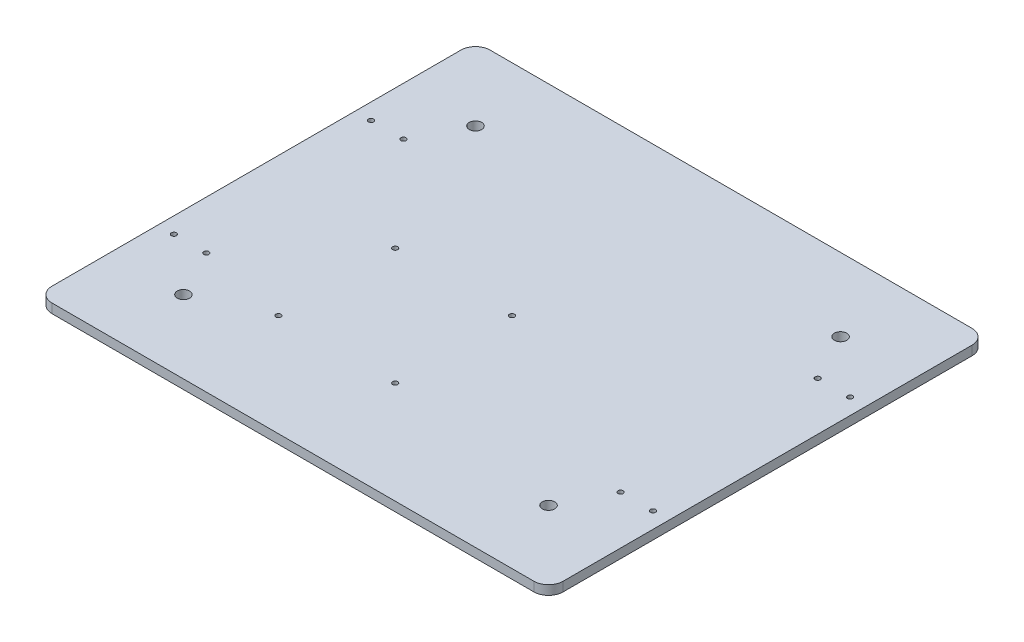
ISO-10303-21;
HEADER;
FILE_DESCRIPTION(('STEP AP214'),'2;1');
FILE_NAME('part.step','',(''),(''),'','','');
FILE_SCHEMA(('AUTOMOTIVE_DESIGN { 1 0 10303 214 1 1 1 1 }'));
ENDSEC;
DATA;
#1=APPLICATION_CONTEXT('core data for automotive mechanical design processes');
#2=APPLICATION_PROTOCOL_DEFINITION('international standard','automotive_design',2000,#1);
#3=PRODUCT_CONTEXT('',#1,'mechanical');
#4=PRODUCT('Part','Part','',(#3));
#5=PRODUCT_RELATED_PRODUCT_CATEGORY('part','',(#4));
#6=PRODUCT_DEFINITION_FORMATION('','',#4);
#7=PRODUCT_DEFINITION_CONTEXT('part definition',#1,'design');
#8=PRODUCT_DEFINITION('design','',#6,#7);
#9=PRODUCT_DEFINITION_SHAPE('','',#8);
#10=(LENGTH_UNIT() NAMED_UNIT(*) SI_UNIT(.MILLI.,.METRE.));
#11=(NAMED_UNIT(*) PLANE_ANGLE_UNIT() SI_UNIT($,.RADIAN.));
#12=(NAMED_UNIT(*) SI_UNIT($,.STERADIAN.) SOLID_ANGLE_UNIT());
#13=UNCERTAINTY_MEASURE_WITH_UNIT(LENGTH_MEASURE(1.E-05),#10,'distance_accuracy_value','');
#14=(GEOMETRIC_REPRESENTATION_CONTEXT(3) GLOBAL_UNCERTAINTY_ASSIGNED_CONTEXT((#13)) GLOBAL_UNIT_ASSIGNED_CONTEXT((#10,
#11,#12)) REPRESENTATION_CONTEXT('',''));
#15=CARTESIAN_POINT('',(0.,0.,0.));
#16=DIRECTION('',(0.,0.,1.));
#17=DIRECTION('',(1.,0.,0.));
#18=AXIS2_PLACEMENT_3D('',#15,#16,#17);
#19=CARTESIAN_POINT('',(-175.,6.35,150.));
#20=DIRECTION('',(1.,0.,0.));
#21=DIRECTION('',(0.,0.,-1.));
#22=AXIS2_PLACEMENT_3D('',#19,#20,#21);
#23=PLANE('',#22);
#24=DIRECTION('',(0.,0.,1.));
#25=VECTOR('',#24,1.);
#26=CARTESIAN_POINT('',(-175.,0.,150.));
#27=LINE('',#26,#25);
#28=CARTESIAN_POINT('',(-175.,0.,-140.));
#29=VERTEX_POINT('',#28);
#30=CARTESIAN_POINT('',(-175.,0.,140.));
#31=VERTEX_POINT('',#30);
#32=EDGE_CURVE('E134',#29,#31,#27,.T.);
#33=ORIENTED_EDGE('',*,*,#32,.T.);
#34=DIRECTION('',(0.,-1.,0.));
#35=VECTOR('',#34,1.);
#36=CARTESIAN_POINT('',(-175.,6.35,140.));
#37=LINE('',#36,#35);
#38=CARTESIAN_POINT('',(-175.,6.35,140.));
#39=VERTEX_POINT('',#38);
#40=EDGE_CURVE('E111',#31,#39,#37,.F.);
#41=ORIENTED_EDGE('',*,*,#40,.T.);
#42=DIRECTION('',(0.,0.,1.));
#43=VECTOR('',#42,1.);
#44=CARTESIAN_POINT('',(-175.,6.35,150.));
#45=LINE('',#44,#43);
#46=CARTESIAN_POINT('',(-175.,6.35,-140.));
#47=VERTEX_POINT('',#46);
#48=EDGE_CURVE('E144',#47,#39,#45,.T.);
#49=ORIENTED_EDGE('',*,*,#48,.F.);
#50=DIRECTION('',(0.,-1.,0.));
#51=VECTOR('',#50,1.);
#52=CARTESIAN_POINT('',(-175.,6.35,-140.));
#53=LINE('',#52,#51);
#54=EDGE_CURVE('E116',#47,#29,#53,.T.);
#55=ORIENTED_EDGE('',*,*,#54,.T.);
#56=EDGE_LOOP('',(#33,#41,#49,#55));
#57=FACE_BOUND('',#56,.T.);
#58=ADVANCED_FACE('F39',(#57),#23,.F.);
#59=CARTESIAN_POINT('',(175.,6.35,150.));
#60=DIRECTION('',(0.,0.,-1.));
#61=DIRECTION('',(-1.,0.,0.));
#62=AXIS2_PLACEMENT_3D('',#59,#60,#61);
#63=PLANE('',#62);
#64=DIRECTION('',(1.,0.,0.));
#65=VECTOR('',#64,1.);
#66=CARTESIAN_POINT('',(175.,6.35,150.));
#67=LINE('',#66,#65);
#68=CARTESIAN_POINT('',(-165.,6.35,150.));
#69=VERTEX_POINT('',#68);
#70=CARTESIAN_POINT('',(165.,6.35,150.));
#71=VERTEX_POINT('',#70);
#72=EDGE_CURVE('E126',#69,#71,#67,.T.);
#73=ORIENTED_EDGE('',*,*,#72,.F.);
#74=DIRECTION('',(0.,-1.,0.));
#75=VECTOR('',#74,1.);
#76=CARTESIAN_POINT('',(-165.,6.35,150.));
#77=LINE('',#76,#75);
#78=CARTESIAN_POINT('',(-165.,0.,150.));
#79=VERTEX_POINT('',#78);
#80=EDGE_CURVE('E110',#69,#79,#77,.T.);
#81=ORIENTED_EDGE('',*,*,#80,.T.);
#82=DIRECTION('',(1.,0.,0.));
#83=VECTOR('',#82,1.);
#84=CARTESIAN_POINT('',(175.,0.,150.));
#85=LINE('',#84,#83);
#86=CARTESIAN_POINT('',(165.,0.,150.));
#87=VERTEX_POINT('',#86);
#88=EDGE_CURVE('E123',#79,#87,#85,.T.);
#89=ORIENTED_EDGE('',*,*,#88,.T.);
#90=DIRECTION('',(0.,-1.,0.));
#91=VECTOR('',#90,1.);
#92=CARTESIAN_POINT('',(165.,6.35,150.));
#93=LINE('',#92,#91);
#94=EDGE_CURVE('E128',#87,#71,#93,.F.);
#95=ORIENTED_EDGE('',*,*,#94,.T.);
#96=EDGE_LOOP('',(#73,#81,#89,#95));
#97=FACE_BOUND('',#96,.T.);
#98=ADVANCED_FACE('F122',(#97),#63,.F.);
#99=CARTESIAN_POINT('',(175.,6.35,150.));
#100=DIRECTION('',(-1.,0.,0.));
#101=DIRECTION('',(0.,0.,1.));
#102=AXIS2_PLACEMENT_3D('',#99,#100,#101);
#103=PLANE('',#102);
#104=DIRECTION('',(0.,0.,-1.));
#105=VECTOR('',#104,1.);
#106=CARTESIAN_POINT('',(175.,6.35,150.));
#107=LINE('',#106,#105);
#108=CARTESIAN_POINT('',(175.,6.35,140.));
#109=VERTEX_POINT('',#108);
#110=CARTESIAN_POINT('',(175.,6.35,-140.));
#111=VERTEX_POINT('',#110);
#112=EDGE_CURVE('E339',#109,#111,#107,.T.);
#113=ORIENTED_EDGE('',*,*,#112,.F.);
#114=DIRECTION('',(0.,-1.,0.));
#115=VECTOR('',#114,1.);
#116=CARTESIAN_POINT('',(175.,6.35,140.));
#117=LINE('',#116,#115);
#118=CARTESIAN_POINT('',(175.,0.,140.));
#119=VERTEX_POINT('',#118);
#120=EDGE_CURVE('E163',#109,#119,#117,.T.);
#121=ORIENTED_EDGE('',*,*,#120,.T.);
#122=DIRECTION('',(0.,0.,-1.));
#123=VECTOR('',#122,1.);
#124=CARTESIAN_POINT('',(175.,0.,150.));
#125=LINE('',#124,#123);
#126=CARTESIAN_POINT('',(175.,0.,-140.));
#127=VERTEX_POINT('',#126);
#128=EDGE_CURVE('E133',#119,#127,#125,.T.);
#129=ORIENTED_EDGE('',*,*,#128,.T.);
#130=DIRECTION('',(0.,-1.,0.));
#131=VECTOR('',#130,1.);
#132=CARTESIAN_POINT('',(175.,6.35,-140.));
#133=LINE('',#132,#131);
#134=EDGE_CURVE('E161',#127,#111,#133,.F.);
#135=ORIENTED_EDGE('',*,*,#134,.T.);
#136=EDGE_LOOP('',(#113,#121,#129,#135));
#137=FACE_BOUND('',#136,.T.);
#138=ADVANCED_FACE('F232',(#137),#103,.F.);
#139=CARTESIAN_POINT('',(175.,6.35,-150.));
#140=DIRECTION('',(0.,0.,1.));
#141=DIRECTION('',(1.,0.,0.));
#142=AXIS2_PLACEMENT_3D('',#139,#140,#141);
#143=PLANE('',#142);
#144=DIRECTION('',(-1.,0.,0.));
#145=VECTOR('',#144,1.);
#146=CARTESIAN_POINT('',(175.,6.35,-150.));
#147=LINE('',#146,#145);
#148=CARTESIAN_POINT('',(165.,6.35,-150.));
#149=VERTEX_POINT('',#148);
#150=CARTESIAN_POINT('',(-165.,6.35,-150.));
#151=VERTEX_POINT('',#150);
#152=EDGE_CURVE('E145',#149,#151,#147,.T.);
#153=ORIENTED_EDGE('',*,*,#152,.F.);
#154=DIRECTION('',(0.,-1.,0.));
#155=VECTOR('',#154,1.);
#156=CARTESIAN_POINT('',(165.,6.35,-150.));
#157=LINE('',#156,#155);
#158=CARTESIAN_POINT('',(165.,0.,-150.));
#159=VERTEX_POINT('',#158);
#160=EDGE_CURVE('E167',#149,#159,#157,.T.);
#161=ORIENTED_EDGE('',*,*,#160,.T.);
#162=DIRECTION('',(-1.,0.,0.));
#163=VECTOR('',#162,1.);
#164=CARTESIAN_POINT('',(175.,0.,-150.));
#165=LINE('',#164,#163);
#166=CARTESIAN_POINT('',(-165.,0.,-150.));
#167=VERTEX_POINT('',#166);
#168=EDGE_CURVE('E137',#159,#167,#165,.T.);
#169=ORIENTED_EDGE('',*,*,#168,.T.);
#170=DIRECTION('',(0.,-1.,0.));
#171=VECTOR('',#170,1.);
#172=CARTESIAN_POINT('',(-165.,6.35,-150.));
#173=LINE('',#172,#171);
#174=EDGE_CURVE('E54',#167,#151,#173,.F.);
#175=ORIENTED_EDGE('',*,*,#174,.T.);
#176=EDGE_LOOP('',(#153,#161,#169,#175));
#177=FACE_BOUND('',#176,.T.);
#178=ADVANCED_FACE('F220',(#177),#143,.F.);
#179=CARTESIAN_POINT('',(0.,6.35,0.));
#180=DIRECTION('',(0.,1.,0.));
#181=DIRECTION('',(0.,0.,1.));
#182=AXIS2_PLACEMENT_3D('',#179,#180,#181);
#183=PLANE('',#182);
#184=CARTESIAN_POINT('',(164.05,6.35,-67.5));
#185=DIRECTION('',(0.,-1.,0.));
#186=DIRECTION('',(0.,0.,-1.));
#187=AXIS2_PLACEMENT_3D('',#184,#185,#186);
#188=CIRCLE('',#187,1.75000000000001);
#189=CARTESIAN_POINT('',(164.05,6.35,-69.25));
#190=VERTEX_POINT('',#189);
#191=EDGE_CURVE('E567',#190,#190,#188,.T.);
#192=ORIENTED_EDGE('',*,*,#191,.T.);
#193=EDGE_LOOP('',(#192));
#194=FACE_BOUND('',#193,.T.);
#195=CARTESIAN_POINT('',(141.82,6.35,-67.5));
#196=DIRECTION('',(0.,-1.,0.));
#197=DIRECTION('',(0.,0.,-1.));
#198=AXIS2_PLACEMENT_3D('',#195,#196,#197);
#199=CIRCLE('',#198,1.75000000000001);
#200=CARTESIAN_POINT('',(141.82,6.35,-69.25));
#201=VERTEX_POINT('',#200);
#202=EDGE_CURVE('E558',#201,#201,#199,.T.);
#203=ORIENTED_EDGE('',*,*,#202,.T.);
#204=EDGE_LOOP('',(#203));
#205=FACE_BOUND('',#204,.T.);
#206=CARTESIAN_POINT('',(-164.05,6.35,-67.5));
#207=DIRECTION('',(0.,-1.,0.));
#208=DIRECTION('',(0.,0.,-1.));
#209=AXIS2_PLACEMENT_3D('',#206,#207,#208);
#210=CIRCLE('',#209,1.75000000000001);
#211=CARTESIAN_POINT('',(-164.05,6.35,-69.25));
#212=VERTEX_POINT('',#211);
#213=EDGE_CURVE('E555',#212,#212,#210,.T.);
#214=ORIENTED_EDGE('',*,*,#213,.T.);
#215=EDGE_LOOP('',(#214));
#216=FACE_BOUND('',#215,.T.);
#217=CARTESIAN_POINT('',(-141.82,6.35,-67.5));
#218=DIRECTION('',(0.,-1.,0.));
#219=DIRECTION('',(0.,0.,-1.));
#220=AXIS2_PLACEMENT_3D('',#217,#218,#219);
#221=CIRCLE('',#220,1.75000000000001);
#222=CARTESIAN_POINT('',(-141.82,6.35,-69.25));
#223=VERTEX_POINT('',#222);
#224=EDGE_CURVE('E546',#223,#223,#221,.T.);
#225=ORIENTED_EDGE('',*,*,#224,.T.);
#226=EDGE_LOOP('',(#225));
#227=FACE_BOUND('',#226,.T.);
#228=CARTESIAN_POINT('',(-80.,6.35,0.));
#229=DIRECTION('',(0.,-1.,0.));
#230=DIRECTION('',(0.,0.,-1.));
#231=AXIS2_PLACEMENT_3D('',#228,#229,#230);
#232=CIRCLE('',#231,1.75);
#233=CARTESIAN_POINT('',(-80.,6.35,-1.75));
#234=VERTEX_POINT('',#233);
#235=EDGE_CURVE('E543',#234,#234,#232,.T.);
#236=ORIENTED_EDGE('',*,*,#235,.T.);
#237=EDGE_LOOP('',(#236));
#238=FACE_BOUND('',#237,.T.);
#239=CARTESIAN_POINT('',(0.,6.35,0.));
#240=DIRECTION('',(0.,-1.,0.));
#241=DIRECTION('',(0.,0.,-1.));
#242=AXIS2_PLACEMENT_3D('',#239,#240,#241);
#243=CIRCLE('',#242,1.75);
#244=CARTESIAN_POINT('',(0.,6.35,-1.75));
#245=VERTEX_POINT('',#244);
#246=EDGE_CURVE('E532',#245,#245,#243,.T.);
#247=ORIENTED_EDGE('',*,*,#246,.T.);
#248=EDGE_LOOP('',(#247));
#249=FACE_BOUND('',#248,.T.);
#250=CARTESIAN_POINT('',(125.,6.35,100.));
#251=DIRECTION('',(0.,-1.,0.));
#252=DIRECTION('',(0.,0.,-1.));
#253=AXIS2_PLACEMENT_3D('',#250,#251,#252);
#254=CIRCLE('',#253,4.25000000000001);
#255=CARTESIAN_POINT('',(125.,6.35,95.75));
#256=VERTEX_POINT('',#255);
#257=EDGE_CURVE('E527',#256,#256,#254,.T.);
#258=ORIENTED_EDGE('',*,*,#257,.T.);
#259=EDGE_LOOP('',(#258));
#260=FACE_BOUND('',#259,.T.);
#261=CARTESIAN_POINT('',(125.,6.35,-100.));
#262=DIRECTION('',(0.,-1.,0.));
#263=DIRECTION('',(0.,0.,-1.));
#264=AXIS2_PLACEMENT_3D('',#261,#262,#263);
#265=CIRCLE('',#264,4.25000000000001);
#266=CARTESIAN_POINT('',(125.,6.35,-104.25));
#267=VERTEX_POINT('',#266);
#268=EDGE_CURVE('E323',#267,#267,#265,.T.);
#269=ORIENTED_EDGE('',*,*,#268,.T.);
#270=EDGE_LOOP('',(#269));
#271=FACE_BOUND('',#270,.T.);
#272=CARTESIAN_POINT('',(-125.,6.35,100.));
#273=DIRECTION('',(0.,-1.,0.));
#274=DIRECTION('',(0.,0.,-1.));
#275=AXIS2_PLACEMENT_3D('',#272,#273,#274);
#276=CIRCLE('',#275,4.25000000000001);
#277=CARTESIAN_POINT('',(-125.,6.35,95.75));
#278=VERTEX_POINT('',#277);
#279=EDGE_CURVE('E318',#278,#278,#276,.T.);
#280=ORIENTED_EDGE('',*,*,#279,.T.);
#281=EDGE_LOOP('',(#280));
#282=FACE_BOUND('',#281,.T.);
#283=CARTESIAN_POINT('',(-125.,6.35,-100.));
#284=DIRECTION('',(0.,-1.,0.));
#285=DIRECTION('',(0.,0.,-1.));
#286=AXIS2_PLACEMENT_3D('',#283,#284,#285);
#287=CIRCLE('',#286,4.25000000000001);
#288=CARTESIAN_POINT('',(-125.,6.35,-104.25));
#289=VERTEX_POINT('',#288);
#290=EDGE_CURVE('E139',#289,#289,#287,.T.);
#291=ORIENTED_EDGE('',*,*,#290,.T.);
#292=EDGE_LOOP('',(#291));
#293=FACE_BOUND('',#292,.T.);
#294=ORIENTED_EDGE('',*,*,#48,.T.);
#295=CARTESIAN_POINT('',(-165.,6.35,140.));
#296=DIRECTION('',(0.,1.,0.));
#297=DIRECTION('',(0.,0.,1.));
#298=AXIS2_PLACEMENT_3D('',#295,#296,#297);
#299=CIRCLE('',#298,10.);
#300=EDGE_CURVE('E159',#39,#69,#299,.T.);
#301=ORIENTED_EDGE('',*,*,#300,.T.);
#302=ORIENTED_EDGE('',*,*,#72,.T.);
#303=CARTESIAN_POINT('',(165.,6.35,140.));
#304=DIRECTION('',(0.,1.,0.));
#305=DIRECTION('',(0.,0.,1.));
#306=AXIS2_PLACEMENT_3D('',#303,#304,#305);
#307=CIRCLE('',#306,10.);
#308=EDGE_CURVE('E157',#71,#109,#307,.T.);
#309=ORIENTED_EDGE('',*,*,#308,.T.);
#310=ORIENTED_EDGE('',*,*,#112,.T.);
#311=CARTESIAN_POINT('',(165.,6.35,-140.));
#312=DIRECTION('',(0.,1.,0.));
#313=DIRECTION('',(0.,0.,1.));
#314=AXIS2_PLACEMENT_3D('',#311,#312,#313);
#315=CIRCLE('',#314,10.);
#316=EDGE_CURVE('E61',#111,#149,#315,.T.);
#317=ORIENTED_EDGE('',*,*,#316,.T.);
#318=ORIENTED_EDGE('',*,*,#152,.T.);
#319=CARTESIAN_POINT('',(-165.,6.35,-140.));
#320=DIRECTION('',(0.,1.,0.));
#321=DIRECTION('',(0.,0.,1.));
#322=AXIS2_PLACEMENT_3D('',#319,#320,#321);
#323=CIRCLE('',#322,10.);
#324=EDGE_CURVE('E154',#151,#47,#323,.T.);
#325=ORIENTED_EDGE('',*,*,#324,.T.);
#326=EDGE_LOOP('',(#294,#301,#302,#309,#310,#317,#318,#325));
#327=FACE_BOUND('',#326,.T.);
#328=CARTESIAN_POINT('',(0.,6.35,80.));
#329=DIRECTION('',(0.,-1.,0.));
#330=DIRECTION('',(0.,0.,-1.));
#331=AXIS2_PLACEMENT_3D('',#328,#329,#330);
#332=CIRCLE('',#331,1.75);
#333=CARTESIAN_POINT('',(0.,6.35,78.25));
#334=VERTEX_POINT('',#333);
#335=EDGE_CURVE('E170',#334,#334,#332,.T.);
#336=ORIENTED_EDGE('',*,*,#335,.T.);
#337=EDGE_LOOP('',(#336));
#338=FACE_BOUND('',#337,.T.);
#339=CARTESIAN_POINT('',(-80.,6.35,80.));
#340=DIRECTION('',(0.,-1.,0.));
#341=DIRECTION('',(0.,0.,-1.));
#342=AXIS2_PLACEMENT_3D('',#339,#340,#341);
#343=CIRCLE('',#342,1.75);
#344=CARTESIAN_POINT('',(-80.,6.35,78.25));
#345=VERTEX_POINT('',#344);
#346=EDGE_CURVE('E176',#345,#345,#343,.T.);
#347=ORIENTED_EDGE('',*,*,#346,.T.);
#348=EDGE_LOOP('',(#347));
#349=FACE_BOUND('',#348,.T.);
#350=CARTESIAN_POINT('',(-141.82,6.35,67.5));
#351=DIRECTION('',(0.,-1.,0.));
#352=DIRECTION('',(0.,0.,-1.));
#353=AXIS2_PLACEMENT_3D('',#350,#351,#352);
#354=CIRCLE('',#353,1.75000000000001);
#355=CARTESIAN_POINT('',(-141.82,6.35,65.75));
#356=VERTEX_POINT('',#355);
#357=EDGE_CURVE('E182',#356,#356,#354,.T.);
#358=ORIENTED_EDGE('',*,*,#357,.T.);
#359=EDGE_LOOP('',(#358));
#360=FACE_BOUND('',#359,.T.);
#361=CARTESIAN_POINT('',(-164.05,6.35,67.5));
#362=DIRECTION('',(0.,-1.,0.));
#363=DIRECTION('',(0.,0.,-1.));
#364=AXIS2_PLACEMENT_3D('',#361,#362,#363);
#365=CIRCLE('',#364,1.75000000000001);
#366=CARTESIAN_POINT('',(-164.05,6.35,65.75));
#367=VERTEX_POINT('',#366);
#368=EDGE_CURVE('E188',#367,#367,#365,.T.);
#369=ORIENTED_EDGE('',*,*,#368,.T.);
#370=EDGE_LOOP('',(#369));
#371=FACE_BOUND('',#370,.T.);
#372=CARTESIAN_POINT('',(141.82,6.35,67.5));
#373=DIRECTION('',(0.,-1.,0.));
#374=DIRECTION('',(0.,0.,-1.));
#375=AXIS2_PLACEMENT_3D('',#372,#373,#374);
#376=CIRCLE('',#375,1.75000000000001);
#377=CARTESIAN_POINT('',(141.82,6.35,65.75));
#378=VERTEX_POINT('',#377);
#379=EDGE_CURVE('E194',#378,#378,#376,.T.);
#380=ORIENTED_EDGE('',*,*,#379,.T.);
#381=EDGE_LOOP('',(#380));
#382=FACE_BOUND('',#381,.T.);
#383=CARTESIAN_POINT('',(164.05,6.35,67.5));
#384=DIRECTION('',(0.,-1.,0.));
#385=DIRECTION('',(0.,0.,-1.));
#386=AXIS2_PLACEMENT_3D('',#383,#384,#385);
#387=CIRCLE('',#386,1.75000000000001);
#388=CARTESIAN_POINT('',(164.05,6.35,65.75));
#389=VERTEX_POINT('',#388);
#390=EDGE_CURVE('E47',#389,#389,#387,.T.);
#391=ORIENTED_EDGE('',*,*,#390,.T.);
#392=EDGE_LOOP('',(#391));
#393=FACE_BOUND('',#392,.T.);
#394=ADVANCED_FACE('F202',(#194,#205,#216,#227,#238,#249,#260,#271,#282,#293,#327,#338,#349,
#360,#371,#382,#393),#183,.T.);
#395=CARTESIAN_POINT('',(0.,0.,0.));
#396=DIRECTION('',(0.,1.,0.));
#397=DIRECTION('',(0.,0.,1.));
#398=AXIS2_PLACEMENT_3D('',#395,#396,#397);
#399=PLANE('',#398);
#400=CARTESIAN_POINT('',(164.05,0.,-67.5));
#401=DIRECTION('',(0.,-1.,0.));
#402=DIRECTION('',(0.,0.,-1.));
#403=AXIS2_PLACEMENT_3D('',#400,#401,#402);
#404=CIRCLE('',#403,1.75000000000001);
#405=CARTESIAN_POINT('',(164.05,0.,-69.25));
#406=VERTEX_POINT('',#405);
#407=EDGE_CURVE('E562',#406,#406,#404,.T.);
#408=ORIENTED_EDGE('',*,*,#407,.F.);
#409=EDGE_LOOP('',(#408));
#410=FACE_BOUND('',#409,.T.);
#411=CARTESIAN_POINT('',(141.82,0.,-67.5));
#412=DIRECTION('',(0.,-1.,0.));
#413=DIRECTION('',(0.,0.,-1.));
#414=AXIS2_PLACEMENT_3D('',#411,#412,#413);
#415=CIRCLE('',#414,1.75000000000001);
#416=CARTESIAN_POINT('',(141.82,0.,-69.25));
#417=VERTEX_POINT('',#416);
#418=EDGE_CURVE('E559',#417,#417,#415,.T.);
#419=ORIENTED_EDGE('',*,*,#418,.F.);
#420=EDGE_LOOP('',(#419));
#421=FACE_BOUND('',#420,.T.);
#422=CARTESIAN_POINT('',(-164.05,0.,-67.5));
#423=DIRECTION('',(0.,-1.,0.));
#424=DIRECTION('',(0.,0.,-1.));
#425=AXIS2_PLACEMENT_3D('',#422,#423,#424);
#426=CIRCLE('',#425,1.75000000000001);
#427=CARTESIAN_POINT('',(-164.05,0.,-69.25));
#428=VERTEX_POINT('',#427);
#429=EDGE_CURVE('E550',#428,#428,#426,.T.);
#430=ORIENTED_EDGE('',*,*,#429,.F.);
#431=EDGE_LOOP('',(#430));
#432=FACE_BOUND('',#431,.T.);
#433=CARTESIAN_POINT('',(-141.82,0.,-67.5));
#434=DIRECTION('',(0.,-1.,0.));
#435=DIRECTION('',(0.,0.,-1.));
#436=AXIS2_PLACEMENT_3D('',#433,#434,#435);
#437=CIRCLE('',#436,1.75000000000001);
#438=CARTESIAN_POINT('',(-141.82,0.,-69.25));
#439=VERTEX_POINT('',#438);
#440=EDGE_CURVE('E547',#439,#439,#437,.T.);
#441=ORIENTED_EDGE('',*,*,#440,.F.);
#442=EDGE_LOOP('',(#441));
#443=FACE_BOUND('',#442,.T.);
#444=CARTESIAN_POINT('',(-80.,0.,0.));
#445=DIRECTION('',(0.,-1.,0.));
#446=DIRECTION('',(0.,0.,-1.));
#447=AXIS2_PLACEMENT_3D('',#444,#445,#446);
#448=CIRCLE('',#447,1.75);
#449=CARTESIAN_POINT('',(-80.,0.,-1.75));
#450=VERTEX_POINT('',#449);
#451=EDGE_CURVE('E538',#450,#450,#448,.T.);
#452=ORIENTED_EDGE('',*,*,#451,.F.);
#453=EDGE_LOOP('',(#452));
#454=FACE_BOUND('',#453,.T.);
#455=CARTESIAN_POINT('',(0.,0.,0.));
#456=DIRECTION('',(0.,-1.,0.));
#457=DIRECTION('',(0.,0.,-1.));
#458=AXIS2_PLACEMENT_3D('',#455,#456,#457);
#459=CIRCLE('',#458,1.75);
#460=CARTESIAN_POINT('',(0.,0.,-1.75));
#461=VERTEX_POINT('',#460);
#462=EDGE_CURVE('E535',#461,#461,#459,.T.);
#463=ORIENTED_EDGE('',*,*,#462,.F.);
#464=EDGE_LOOP('',(#463));
#465=FACE_BOUND('',#464,.T.);
#466=CARTESIAN_POINT('',(125.,0.,100.));
#467=DIRECTION('',(0.,-1.,0.));
#468=DIRECTION('',(0.,0.,-1.));
#469=AXIS2_PLACEMENT_3D('',#466,#467,#468);
#470=CIRCLE('',#469,4.25000000000001);
#471=CARTESIAN_POINT('',(125.,0.,95.75));
#472=VERTEX_POINT('',#471);
#473=EDGE_CURVE('E529',#472,#472,#470,.T.);
#474=ORIENTED_EDGE('',*,*,#473,.F.);
#475=EDGE_LOOP('',(#474));
#476=FACE_BOUND('',#475,.T.);
#477=CARTESIAN_POINT('',(125.,0.,-100.));
#478=DIRECTION('',(0.,-1.,0.));
#479=DIRECTION('',(0.,0.,-1.));
#480=AXIS2_PLACEMENT_3D('',#477,#478,#479);
#481=CIRCLE('',#480,4.25000000000001);
#482=CARTESIAN_POINT('',(125.,0.,-104.25));
#483=VERTEX_POINT('',#482);
#484=EDGE_CURVE('E328',#483,#483,#481,.T.);
#485=ORIENTED_EDGE('',*,*,#484,.F.);
#486=EDGE_LOOP('',(#485));
#487=FACE_BOUND('',#486,.T.);
#488=CARTESIAN_POINT('',(-125.,0.,100.));
#489=DIRECTION('',(0.,-1.,0.));
#490=DIRECTION('',(0.,0.,-1.));
#491=AXIS2_PLACEMENT_3D('',#488,#489,#490);
#492=CIRCLE('',#491,4.25000000000001);
#493=CARTESIAN_POINT('',(-125.,0.,95.75));
#494=VERTEX_POINT('',#493);
#495=EDGE_CURVE('E321',#494,#494,#492,.T.);
#496=ORIENTED_EDGE('',*,*,#495,.F.);
#497=EDGE_LOOP('',(#496));
#498=FACE_BOUND('',#497,.T.);
#499=CARTESIAN_POINT('',(-125.,0.,-100.));
#500=DIRECTION('',(0.,-1.,0.));
#501=DIRECTION('',(0.,0.,-1.));
#502=AXIS2_PLACEMENT_3D('',#499,#500,#501);
#503=CIRCLE('',#502,4.25000000000001);
#504=CARTESIAN_POINT('',(-125.,0.,-104.25));
#505=VERTEX_POINT('',#504);
#506=EDGE_CURVE('E325',#505,#505,#503,.T.);
#507=ORIENTED_EDGE('',*,*,#506,.F.);
#508=EDGE_LOOP('',(#507));
#509=FACE_BOUND('',#508,.T.);
#510=ORIENTED_EDGE('',*,*,#88,.F.);
#511=CARTESIAN_POINT('',(-165.,0.,140.));
#512=DIRECTION('',(0.,1.,0.));
#513=DIRECTION('',(0.,0.,1.));
#514=AXIS2_PLACEMENT_3D('',#511,#512,#513);
#515=CIRCLE('',#514,10.);
#516=EDGE_CURVE('E106',#79,#31,#515,.F.);
#517=ORIENTED_EDGE('',*,*,#516,.T.);
#518=ORIENTED_EDGE('',*,*,#32,.F.);
#519=CARTESIAN_POINT('',(-165.,0.,-140.));
#520=DIRECTION('',(0.,1.,0.));
#521=DIRECTION('',(0.,0.,1.));
#522=AXIS2_PLACEMENT_3D('',#519,#520,#521);
#523=CIRCLE('',#522,10.);
#524=EDGE_CURVE('E127',#29,#167,#523,.F.);
#525=ORIENTED_EDGE('',*,*,#524,.T.);
#526=ORIENTED_EDGE('',*,*,#168,.F.);
#527=CARTESIAN_POINT('',(165.,0.,-140.));
#528=DIRECTION('',(0.,1.,0.));
#529=DIRECTION('',(0.,0.,1.));
#530=AXIS2_PLACEMENT_3D('',#527,#528,#529);
#531=CIRCLE('',#530,10.);
#532=EDGE_CURVE('E148',#159,#127,#531,.F.);
#533=ORIENTED_EDGE('',*,*,#532,.T.);
#534=ORIENTED_EDGE('',*,*,#128,.F.);
#535=CARTESIAN_POINT('',(165.,0.,140.));
#536=DIRECTION('',(0.,1.,0.));
#537=DIRECTION('',(0.,0.,1.));
#538=AXIS2_PLACEMENT_3D('',#535,#536,#537);
#539=CIRCLE('',#538,10.);
#540=EDGE_CURVE('E117',#119,#87,#539,.F.);
#541=ORIENTED_EDGE('',*,*,#540,.T.);
#542=EDGE_LOOP('',(#510,#517,#518,#525,#526,#533,#534,#541));
#543=FACE_BOUND('',#542,.T.);
#544=CARTESIAN_POINT('',(0.,0.,80.));
#545=DIRECTION('',(0.,-1.,0.));
#546=DIRECTION('',(0.,0.,-1.));
#547=AXIS2_PLACEMENT_3D('',#544,#545,#546);
#548=CIRCLE('',#547,1.75);
#549=CARTESIAN_POINT('',(0.,0.,78.25));
#550=VERTEX_POINT('',#549);
#551=EDGE_CURVE('E173',#550,#550,#548,.T.);
#552=ORIENTED_EDGE('',*,*,#551,.F.);
#553=EDGE_LOOP('',(#552));
#554=FACE_BOUND('',#553,.T.);
#555=CARTESIAN_POINT('',(-80.,0.,80.));
#556=DIRECTION('',(0.,-1.,0.));
#557=DIRECTION('',(0.,0.,-1.));
#558=AXIS2_PLACEMENT_3D('',#555,#556,#557);
#559=CIRCLE('',#558,1.75);
#560=CARTESIAN_POINT('',(-80.,0.,78.25));
#561=VERTEX_POINT('',#560);
#562=EDGE_CURVE('E179',#561,#561,#559,.T.);
#563=ORIENTED_EDGE('',*,*,#562,.F.);
#564=EDGE_LOOP('',(#563));
#565=FACE_BOUND('',#564,.T.);
#566=CARTESIAN_POINT('',(-141.82,0.,67.5));
#567=DIRECTION('',(0.,-1.,0.));
#568=DIRECTION('',(0.,0.,-1.));
#569=AXIS2_PLACEMENT_3D('',#566,#567,#568);
#570=CIRCLE('',#569,1.75000000000001);
#571=CARTESIAN_POINT('',(-141.82,0.,65.75));
#572=VERTEX_POINT('',#571);
#573=EDGE_CURVE('E185',#572,#572,#570,.T.);
#574=ORIENTED_EDGE('',*,*,#573,.F.);
#575=EDGE_LOOP('',(#574));
#576=FACE_BOUND('',#575,.T.);
#577=CARTESIAN_POINT('',(-164.05,0.,67.5));
#578=DIRECTION('',(0.,-1.,0.));
#579=DIRECTION('',(0.,0.,-1.));
#580=AXIS2_PLACEMENT_3D('',#577,#578,#579);
#581=CIRCLE('',#580,1.75000000000001);
#582=CARTESIAN_POINT('',(-164.05,0.,65.75));
#583=VERTEX_POINT('',#582);
#584=EDGE_CURVE('E191',#583,#583,#581,.T.);
#585=ORIENTED_EDGE('',*,*,#584,.F.);
#586=EDGE_LOOP('',(#585));
#587=FACE_BOUND('',#586,.T.);
#588=CARTESIAN_POINT('',(141.82,0.,67.5));
#589=DIRECTION('',(0.,-1.,0.));
#590=DIRECTION('',(0.,0.,-1.));
#591=AXIS2_PLACEMENT_3D('',#588,#589,#590);
#592=CIRCLE('',#591,1.75000000000001);
#593=CARTESIAN_POINT('',(141.82,0.,65.75));
#594=VERTEX_POINT('',#593);
#595=EDGE_CURVE('E197',#594,#594,#592,.T.);
#596=ORIENTED_EDGE('',*,*,#595,.F.);
#597=EDGE_LOOP('',(#596));
#598=FACE_BOUND('',#597,.T.);
#599=CARTESIAN_POINT('',(164.05,0.,67.5));
#600=DIRECTION('',(0.,-1.,0.));
#601=DIRECTION('',(0.,0.,-1.));
#602=AXIS2_PLACEMENT_3D('',#599,#600,#601);
#603=CIRCLE('',#602,1.75000000000001);
#604=CARTESIAN_POINT('',(164.05,0.,65.75));
#605=VERTEX_POINT('',#604);
#606=EDGE_CURVE('E11',#605,#605,#603,.T.);
#607=ORIENTED_EDGE('',*,*,#606,.F.);
#608=EDGE_LOOP('',(#607));
#609=FACE_BOUND('',#608,.T.);
#610=ADVANCED_FACE('F130',(#410,#421,#432,#443,#454,#465,#476,#487,#498,#509,#543,#554,#565,
#576,#587,#598,#609),#399,.F.);
#611=CARTESIAN_POINT('',(-125.,6.35,-100.));
#612=DIRECTION('',(0.,-1.,0.));
#613=DIRECTION('',(0.,0.,-1.));
#614=AXIS2_PLACEMENT_3D('',#611,#612,#613);
#615=CYLINDRICAL_SURFACE('',#614,4.25000000000001);
#616=ORIENTED_EDGE('',*,*,#290,.F.);
#617=EDGE_LOOP('',(#616));
#618=FACE_BOUND('',#617,.T.);
#619=ORIENTED_EDGE('',*,*,#506,.T.);
#620=EDGE_LOOP('',(#619));
#621=FACE_BOUND('',#620,.T.);
#622=ADVANCED_FACE('F210',(#618,#621),#615,.F.);
#623=CARTESIAN_POINT('',(-125.,6.35,100.));
#624=DIRECTION('',(0.,-1.,0.));
#625=DIRECTION('',(0.,0.,-1.));
#626=AXIS2_PLACEMENT_3D('',#623,#624,#625);
#627=CYLINDRICAL_SURFACE('',#626,4.25000000000001);
#628=ORIENTED_EDGE('',*,*,#279,.F.);
#629=EDGE_LOOP('',(#628));
#630=FACE_BOUND('',#629,.T.);
#631=ORIENTED_EDGE('',*,*,#495,.T.);
#632=EDGE_LOOP('',(#631));
#633=FACE_BOUND('',#632,.T.);
#634=ADVANCED_FACE('F217',(#630,#633),#627,.F.);
#635=CARTESIAN_POINT('',(125.,6.35,-100.));
#636=DIRECTION('',(0.,-1.,0.));
#637=DIRECTION('',(0.,0.,-1.));
#638=AXIS2_PLACEMENT_3D('',#635,#636,#637);
#639=CYLINDRICAL_SURFACE('',#638,4.25000000000001);
#640=ORIENTED_EDGE('',*,*,#268,.F.);
#641=EDGE_LOOP('',(#640));
#642=FACE_BOUND('',#641,.T.);
#643=ORIENTED_EDGE('',*,*,#484,.T.);
#644=EDGE_LOOP('',(#643));
#645=FACE_BOUND('',#644,.T.);
#646=ADVANCED_FACE('F306',(#642,#645),#639,.F.);
#647=CARTESIAN_POINT('',(125.,6.35,100.));
#648=DIRECTION('',(0.,-1.,0.));
#649=DIRECTION('',(0.,0.,-1.));
#650=AXIS2_PLACEMENT_3D('',#647,#648,#649);
#651=CYLINDRICAL_SURFACE('',#650,4.25000000000001);
#652=ORIENTED_EDGE('',*,*,#257,.F.);
#653=EDGE_LOOP('',(#652));
#654=FACE_BOUND('',#653,.T.);
#655=ORIENTED_EDGE('',*,*,#473,.T.);
#656=EDGE_LOOP('',(#655));
#657=FACE_BOUND('',#656,.T.);
#658=ADVANCED_FACE('F239',(#654,#657),#651,.F.);
#659=CARTESIAN_POINT('',(-165.,6.35,140.));
#660=DIRECTION('',(0.,-1.,0.));
#661=DIRECTION('',(0.,0.,-1.));
#662=AXIS2_PLACEMENT_3D('',#659,#660,#661);
#663=CYLINDRICAL_SURFACE('',#662,10.);
#664=ORIENTED_EDGE('',*,*,#300,.F.);
#665=ORIENTED_EDGE('',*,*,#40,.F.);
#666=ORIENTED_EDGE('',*,*,#516,.F.);
#667=ORIENTED_EDGE('',*,*,#80,.F.);
#668=EDGE_LOOP('',(#664,#665,#666,#667));
#669=FACE_BOUND('',#668,.T.);
#670=ADVANCED_FACE('F109',(#669),#663,.T.);
#671=CARTESIAN_POINT('',(165.,6.35,140.));
#672=DIRECTION('',(0.,-1.,0.));
#673=DIRECTION('',(0.,0.,-1.));
#674=AXIS2_PLACEMENT_3D('',#671,#672,#673);
#675=CYLINDRICAL_SURFACE('',#674,10.);
#676=ORIENTED_EDGE('',*,*,#308,.F.);
#677=ORIENTED_EDGE('',*,*,#94,.F.);
#678=ORIENTED_EDGE('',*,*,#540,.F.);
#679=ORIENTED_EDGE('',*,*,#120,.F.);
#680=EDGE_LOOP('',(#676,#677,#678,#679));
#681=FACE_BOUND('',#680,.T.);
#682=ADVANCED_FACE('F238',(#681),#675,.T.);
#683=CARTESIAN_POINT('',(165.,6.35,-140.));
#684=DIRECTION('',(0.,-1.,0.));
#685=DIRECTION('',(0.,0.,-1.));
#686=AXIS2_PLACEMENT_3D('',#683,#684,#685);
#687=CYLINDRICAL_SURFACE('',#686,10.);
#688=ORIENTED_EDGE('',*,*,#316,.F.);
#689=ORIENTED_EDGE('',*,*,#134,.F.);
#690=ORIENTED_EDGE('',*,*,#532,.F.);
#691=ORIENTED_EDGE('',*,*,#160,.F.);
#692=EDGE_LOOP('',(#688,#689,#690,#691));
#693=FACE_BOUND('',#692,.T.);
#694=ADVANCED_FACE('F242',(#693),#687,.T.);
#695=CARTESIAN_POINT('',(-165.,6.35,-140.));
#696=DIRECTION('',(0.,-1.,0.));
#697=DIRECTION('',(0.,0.,-1.));
#698=AXIS2_PLACEMENT_3D('',#695,#696,#697);
#699=CYLINDRICAL_SURFACE('',#698,10.);
#700=ORIENTED_EDGE('',*,*,#324,.F.);
#701=ORIENTED_EDGE('',*,*,#174,.F.);
#702=ORIENTED_EDGE('',*,*,#524,.F.);
#703=ORIENTED_EDGE('',*,*,#54,.F.);
#704=EDGE_LOOP('',(#700,#701,#702,#703));
#705=FACE_BOUND('',#704,.T.);
#706=ADVANCED_FACE('F246',(#705),#699,.T.);
#707=CARTESIAN_POINT('',(0.,6.35,0.));
#708=DIRECTION('',(0.,-1.,0.));
#709=DIRECTION('',(0.,0.,-1.));
#710=AXIS2_PLACEMENT_3D('',#707,#708,#709);
#711=CYLINDRICAL_SURFACE('',#710,1.75);
#712=ORIENTED_EDGE('',*,*,#246,.F.);
#713=EDGE_LOOP('',(#712));
#714=FACE_BOUND('',#713,.T.);
#715=ORIENTED_EDGE('',*,*,#462,.T.);
#716=EDGE_LOOP('',(#715));
#717=FACE_BOUND('',#716,.T.);
#718=ADVANCED_FACE('F250',(#714,#717),#711,.F.);
#719=CARTESIAN_POINT('',(-80.,6.35,0.));
#720=DIRECTION('',(0.,-1.,0.));
#721=DIRECTION('',(0.,0.,-1.));
#722=AXIS2_PLACEMENT_3D('',#719,#720,#721);
#723=CYLINDRICAL_SURFACE('',#722,1.75);
#724=ORIENTED_EDGE('',*,*,#235,.F.);
#725=EDGE_LOOP('',(#724));
#726=FACE_BOUND('',#725,.T.);
#727=ORIENTED_EDGE('',*,*,#451,.T.);
#728=EDGE_LOOP('',(#727));
#729=FACE_BOUND('',#728,.T.);
#730=ADVANCED_FACE('F256',(#726,#729),#723,.F.);
#731=CARTESIAN_POINT('',(0.,6.35,80.));
#732=DIRECTION('',(0.,-1.,0.));
#733=DIRECTION('',(0.,0.,-1.));
#734=AXIS2_PLACEMENT_3D('',#731,#732,#733);
#735=CYLINDRICAL_SURFACE('',#734,1.75);
#736=ORIENTED_EDGE('',*,*,#335,.F.);
#737=EDGE_LOOP('',(#736));
#738=FACE_BOUND('',#737,.T.);
#739=ORIENTED_EDGE('',*,*,#551,.T.);
#740=EDGE_LOOP('',(#739));
#741=FACE_BOUND('',#740,.T.);
#742=ADVANCED_FACE('F252',(#738,#741),#735,.F.);
#743=CARTESIAN_POINT('',(-80.,6.35,80.));
#744=DIRECTION('',(0.,-1.,0.));
#745=DIRECTION('',(0.,0.,-1.));
#746=AXIS2_PLACEMENT_3D('',#743,#744,#745);
#747=CYLINDRICAL_SURFACE('',#746,1.75);
#748=ORIENTED_EDGE('',*,*,#346,.F.);
#749=EDGE_LOOP('',(#748));
#750=FACE_BOUND('',#749,.T.);
#751=ORIENTED_EDGE('',*,*,#562,.T.);
#752=EDGE_LOOP('',(#751));
#753=FACE_BOUND('',#752,.T.);
#754=ADVANCED_FACE('F255',(#750,#753),#747,.F.);
#755=CARTESIAN_POINT('',(-141.82,6.35,-67.5));
#756=DIRECTION('',(0.,-1.,0.));
#757=DIRECTION('',(0.,0.,-1.));
#758=AXIS2_PLACEMENT_3D('',#755,#756,#757);
#759=CYLINDRICAL_SURFACE('',#758,1.75000000000001);
#760=ORIENTED_EDGE('',*,*,#224,.F.);
#761=EDGE_LOOP('',(#760));
#762=FACE_BOUND('',#761,.T.);
#763=ORIENTED_EDGE('',*,*,#440,.T.);
#764=EDGE_LOOP('',(#763));
#765=FACE_BOUND('',#764,.T.);
#766=ADVANCED_FACE('F260',(#762,#765),#759,.F.);
#767=CARTESIAN_POINT('',(-164.05,6.35,-67.5));
#768=DIRECTION('',(0.,-1.,0.));
#769=DIRECTION('',(0.,0.,-1.));
#770=AXIS2_PLACEMENT_3D('',#767,#768,#769);
#771=CYLINDRICAL_SURFACE('',#770,1.75000000000001);
#772=ORIENTED_EDGE('',*,*,#213,.F.);
#773=EDGE_LOOP('',(#772));
#774=FACE_BOUND('',#773,.T.);
#775=ORIENTED_EDGE('',*,*,#429,.T.);
#776=EDGE_LOOP('',(#775));
#777=FACE_BOUND('',#776,.T.);
#778=ADVANCED_FACE('F266',(#774,#777),#771,.F.);
#779=CARTESIAN_POINT('',(-141.82,6.35,67.5));
#780=DIRECTION('',(0.,-1.,0.));
#781=DIRECTION('',(0.,0.,-1.));
#782=AXIS2_PLACEMENT_3D('',#779,#780,#781);
#783=CYLINDRICAL_SURFACE('',#782,1.75000000000001);
#784=ORIENTED_EDGE('',*,*,#357,.F.);
#785=EDGE_LOOP('',(#784));
#786=FACE_BOUND('',#785,.T.);
#787=ORIENTED_EDGE('',*,*,#573,.T.);
#788=EDGE_LOOP('',(#787));
#789=FACE_BOUND('',#788,.T.);
#790=ADVANCED_FACE('F262',(#786,#789),#783,.F.);
#791=CARTESIAN_POINT('',(-164.05,6.35,67.5));
#792=DIRECTION('',(0.,-1.,0.));
#793=DIRECTION('',(0.,0.,-1.));
#794=AXIS2_PLACEMENT_3D('',#791,#792,#793);
#795=CYLINDRICAL_SURFACE('',#794,1.75000000000001);
#796=ORIENTED_EDGE('',*,*,#368,.F.);
#797=EDGE_LOOP('',(#796));
#798=FACE_BOUND('',#797,.T.);
#799=ORIENTED_EDGE('',*,*,#584,.T.);
#800=EDGE_LOOP('',(#799));
#801=FACE_BOUND('',#800,.T.);
#802=ADVANCED_FACE('F265',(#798,#801),#795,.F.);
#803=CARTESIAN_POINT('',(141.82,6.35,-67.5));
#804=DIRECTION('',(0.,-1.,0.));
#805=DIRECTION('',(0.,0.,-1.));
#806=AXIS2_PLACEMENT_3D('',#803,#804,#805);
#807=CYLINDRICAL_SURFACE('',#806,1.75000000000001);
#808=ORIENTED_EDGE('',*,*,#202,.F.);
#809=EDGE_LOOP('',(#808));
#810=FACE_BOUND('',#809,.T.);
#811=ORIENTED_EDGE('',*,*,#418,.T.);
#812=EDGE_LOOP('',(#811));
#813=FACE_BOUND('',#812,.T.);
#814=ADVANCED_FACE('F269',(#810,#813),#807,.F.);
#815=CARTESIAN_POINT('',(164.05,6.35,-67.5));
#816=DIRECTION('',(0.,-1.,0.));
#817=DIRECTION('',(0.,0.,-1.));
#818=AXIS2_PLACEMENT_3D('',#815,#816,#817);
#819=CYLINDRICAL_SURFACE('',#818,1.75000000000001);
#820=ORIENTED_EDGE('',*,*,#191,.F.);
#821=EDGE_LOOP('',(#820));
#822=FACE_BOUND('',#821,.T.);
#823=ORIENTED_EDGE('',*,*,#407,.T.);
#824=EDGE_LOOP('',(#823));
#825=FACE_BOUND('',#824,.T.);
#826=ADVANCED_FACE('F272',(#822,#825),#819,.F.);
#827=CARTESIAN_POINT('',(141.82,6.35,67.5));
#828=DIRECTION('',(0.,-1.,0.));
#829=DIRECTION('',(0.,0.,-1.));
#830=AXIS2_PLACEMENT_3D('',#827,#828,#829);
#831=CYLINDRICAL_SURFACE('',#830,1.75000000000001);
#832=ORIENTED_EDGE('',*,*,#379,.F.);
#833=EDGE_LOOP('',(#832));
#834=FACE_BOUND('',#833,.T.);
#835=ORIENTED_EDGE('',*,*,#595,.T.);
#836=EDGE_LOOP('',(#835));
#837=FACE_BOUND('',#836,.T.);
#838=ADVANCED_FACE('F206',(#834,#837),#831,.F.);
#839=CARTESIAN_POINT('',(164.05,6.35,67.5));
#840=DIRECTION('',(0.,-1.,0.));
#841=DIRECTION('',(0.,0.,-1.));
#842=AXIS2_PLACEMENT_3D('',#839,#840,#841);
#843=CYLINDRICAL_SURFACE('',#842,1.75000000000001);
#844=ORIENTED_EDGE('',*,*,#390,.F.);
#845=EDGE_LOOP('',(#844));
#846=FACE_BOUND('',#845,.T.);
#847=ORIENTED_EDGE('',*,*,#606,.T.);
#848=EDGE_LOOP('',(#847));
#849=FACE_BOUND('',#848,.T.);
#850=ADVANCED_FACE('F41',(#846,#849),#843,.F.);
#851=CLOSED_SHELL('',(#58,#98,#138,#178,#394,#610,#622,#634,#646,#658,#670,#682,#694,#706,#718,
#730,#742,#754,#766,#778,#790,#802,#814,#826,#838,#850));
#852=MANIFOLD_SOLID_BREP('B2',#851);
#853=ADVANCED_BREP_SHAPE_REPRESENTATION('',(#18,#852),#14);
#854=SHAPE_DEFINITION_REPRESENTATION(#9,#853);
ENDSEC;
END-ISO-10303-21;
